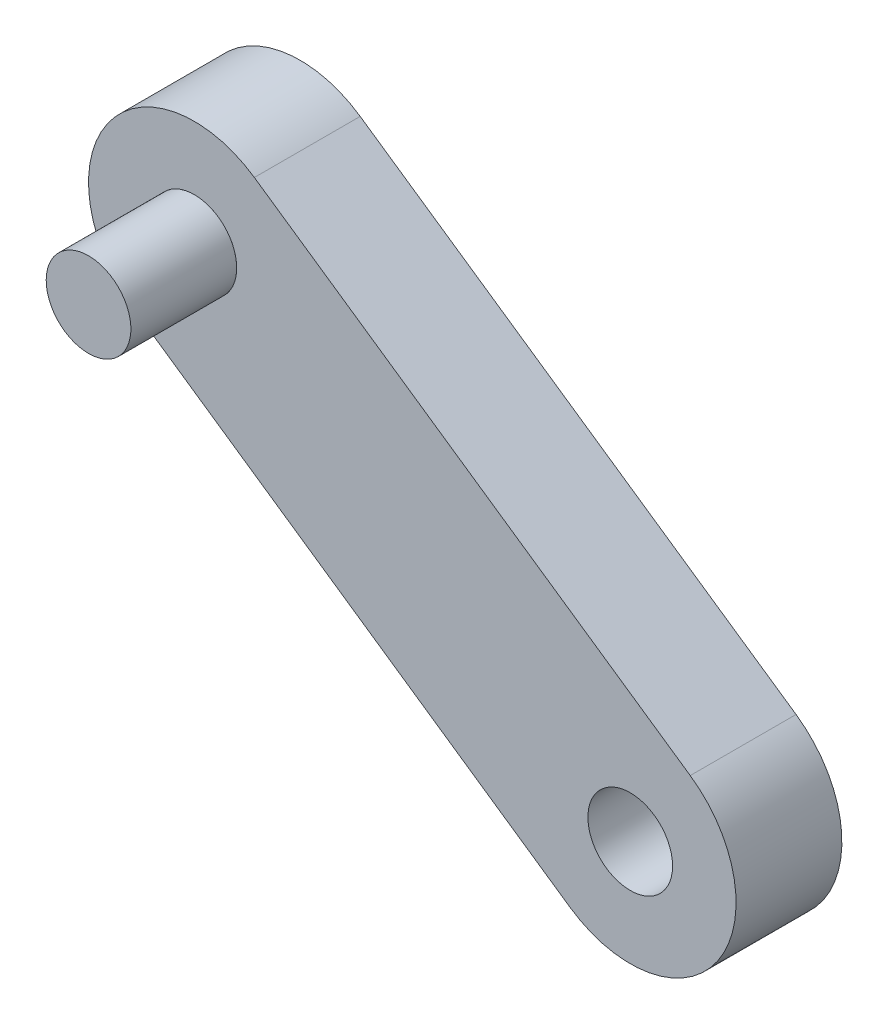
ISO-10303-21;
HEADER;
FILE_DESCRIPTION(('STEP AP214'),'2;1');
FILE_NAME('part.step','',(''),(''),'','','');
FILE_SCHEMA(('AUTOMOTIVE_DESIGN { 1 0 10303 214 1 1 1 1 }'));
ENDSEC;
DATA;
#1=APPLICATION_CONTEXT('core data for automotive mechanical design processes');
#2=APPLICATION_PROTOCOL_DEFINITION('international standard','automotive_design',2000,#1);
#3=PRODUCT_CONTEXT('',#1,'mechanical');
#4=PRODUCT('Part','Part','',(#3));
#5=PRODUCT_RELATED_PRODUCT_CATEGORY('part','',(#4));
#6=PRODUCT_DEFINITION_FORMATION('','',#4);
#7=PRODUCT_DEFINITION_CONTEXT('part definition',#1,'design');
#8=PRODUCT_DEFINITION('design','',#6,#7);
#9=PRODUCT_DEFINITION_SHAPE('','',#8);
#10=(LENGTH_UNIT() NAMED_UNIT(*) SI_UNIT(.MILLI.,.METRE.));
#11=(NAMED_UNIT(*) PLANE_ANGLE_UNIT() SI_UNIT($,.RADIAN.));
#12=(NAMED_UNIT(*) SI_UNIT($,.STERADIAN.) SOLID_ANGLE_UNIT());
#13=UNCERTAINTY_MEASURE_WITH_UNIT(LENGTH_MEASURE(1.E-05),#10,'distance_accuracy_value','');
#14=(GEOMETRIC_REPRESENTATION_CONTEXT(3) GLOBAL_UNCERTAINTY_ASSIGNED_CONTEXT((#13)) GLOBAL_UNIT_ASSIGNED_CONTEXT((#10,
#11,#12)) REPRESENTATION_CONTEXT('',''));
#15=CARTESIAN_POINT('',(0.,0.,0.));
#16=DIRECTION('',(0.,0.,1.));
#17=DIRECTION('',(1.,0.,0.));
#18=AXIS2_PLACEMENT_3D('',#15,#16,#17);
#19=CARTESIAN_POINT('',(-44.3801418640162,84.6953489238267,5.));
#20=DIRECTION('',(0.,0.,-1.));
#21=DIRECTION('',(1.,0.,0.));
#22=AXIS2_PLACEMENT_3D('',#19,#20,#21);
#23=CYLINDRICAL_SURFACE('',#22,2.);
#24=CARTESIAN_POINT('',(-44.3801418640162,84.6953489238267,5.));
#25=DIRECTION('',(0.,0.,-1.));
#26=DIRECTION('',(-1.,0.,0.));
#27=AXIS2_PLACEMENT_3D('',#24,#25,#26);
#28=CIRCLE('',#27,2.);
#29=CARTESIAN_POINT('',(-46.3801418640162,84.6953489238267,5.));
#30=VERTEX_POINT('',#29);
#31=EDGE_CURVE('E11',#30,#30,#28,.T.);
#32=ORIENTED_EDGE('',*,*,#31,.T.);
#33=EDGE_LOOP('',(#32));
#34=FACE_BOUND('',#33,.T.);
#35=CARTESIAN_POINT('',(-44.3801418640162,84.6953489238267,0.));
#36=DIRECTION('',(0.,0.,-1.));
#37=DIRECTION('',(-1.,0.,0.));
#38=AXIS2_PLACEMENT_3D('',#35,#36,#37);
#39=CIRCLE('',#38,2.);
#40=CARTESIAN_POINT('',(-46.3801418640162,84.6953489238267,0.));
#41=VERTEX_POINT('',#40);
#42=EDGE_CURVE('E50',#41,#41,#39,.T.);
#43=ORIENTED_EDGE('',*,*,#42,.F.);
#44=EDGE_LOOP('',(#43));
#45=FACE_BOUND('',#44,.T.);
#46=ADVANCED_FACE('F47',(#34,#45),#23,.T.);
#47=CARTESIAN_POINT('',(-44.3801418640162,84.6953489238267,5.));
#48=DIRECTION('',(0.,0.,1.));
#49=DIRECTION('',(-1.,0.,0.));
#50=AXIS2_PLACEMENT_3D('',#47,#48,#49);
#51=PLANE('',#50);
#52=ORIENTED_EDGE('',*,*,#31,.F.);
#53=EDGE_LOOP('',(#52));
#54=FACE_BOUND('',#53,.T.);
#55=ADVANCED_FACE('F62',(#54),#51,.T.);
#56=CARTESIAN_POINT('',(-44.3801418640162,84.6953489238267,0.));
#57=DIRECTION('',(0.,0.,1.));
#58=DIRECTION('',(-1.,0.,0.));
#59=AXIS2_PLACEMENT_3D('',#56,#57,#58);
#60=PLANE('',#59);
#61=ORIENTED_EDGE('',*,*,#42,.T.);
#62=EDGE_LOOP('',(#61));
#63=FACE_BOUND('',#62,.T.);
#64=ADVANCED_FACE('F59',(#63),#60,.F.);
#65=CLOSED_SHELL('',(#46,#55,#64));
#66=MANIFOLD_SOLID_BREP('B2',#65);
#67=CARTESIAN_POINT('',(22.4546862512256,32.6242146663216,-5.));
#68=DIRECTION('',(0.566966615087807,0.823740770737903,0.));
#69=DIRECTION('',(-0.823740770737903,0.566966615087807,0.));
#70=AXIS2_PLACEMENT_3D('',#67,#68,#69);
#71=PLANE('',#70);
#72=DIRECTION('',(0.823740770737903,-0.566966615087807,0.));
#73=VECTOR('',#72,1.);
#74=CARTESIAN_POINT('',(22.4546862512256,32.6242146663216,0.));
#75=LINE('',#74,#73);
#76=CARTESIAN_POINT('',(-47.2149749394553,80.5766450701372,0.));
#77=VERTEX_POINT('',#76);
#78=CARTESIAN_POINT('',(-26.6214556710077,66.402479692942,0.));
#79=VERTEX_POINT('',#78);
#80=EDGE_CURVE('E160',#77,#79,#75,.T.);
#81=ORIENTED_EDGE('',*,*,#80,.F.);
#82=DIRECTION('',(0.,0.,1.));
#83=VECTOR('',#82,1.);
#84=CARTESIAN_POINT('',(-47.2149749394553,80.5766450701372,-5.));
#85=LINE('',#84,#83);
#86=CARTESIAN_POINT('',(-47.2149749394553,80.5766450701372,-5.));
#87=VERTEX_POINT('',#86);
#88=EDGE_CURVE('E153',#87,#77,#85,.T.);
#89=ORIENTED_EDGE('',*,*,#88,.F.);
#90=DIRECTION('',(0.823740770737903,-0.566966615087807,0.));
#91=VECTOR('',#90,1.);
#92=CARTESIAN_POINT('',(22.4546862512256,32.6242146663216,-5.));
#93=LINE('',#92,#91);
#94=CARTESIAN_POINT('',(-26.6214556710077,66.402479692942,-5.));
#95=VERTEX_POINT('',#94);
#96=EDGE_CURVE('E146',#87,#95,#93,.T.);
#97=ORIENTED_EDGE('',*,*,#96,.T.);
#98=DIRECTION('',(0.,0.,1.));
#99=VECTOR('',#98,1.);
#100=CARTESIAN_POINT('',(-26.6214556710077,66.402479692942,-5.));
#101=LINE('',#100,#99);
#102=EDGE_CURVE('E45',#95,#79,#101,.T.);
#103=ORIENTED_EDGE('',*,*,#102,.T.);
#104=EDGE_LOOP('',(#81,#89,#97,#103));
#105=FACE_BOUND('',#104,.T.);
#106=ADVANCED_FACE('F88',(#105),#71,.F.);
#107=CARTESIAN_POINT('',(-23.7866225955687,70.5211835466315,-5.));
#108=DIRECTION('',(0.,0.,1.));
#109=DIRECTION('',(-1.,0.,0.));
#110=AXIS2_PLACEMENT_3D('',#107,#108,#109);
#111=CYLINDRICAL_SURFACE('',#110,4.99999999999997);
#112=CARTESIAN_POINT('',(-23.7866225955687,70.5211835466315,0.));
#113=DIRECTION('',(0.,0.,1.));
#114=DIRECTION('',(1.,0.,0.));
#115=AXIS2_PLACEMENT_3D('',#112,#113,#114);
#116=CIRCLE('',#115,4.99999999999997);
#117=CARTESIAN_POINT('',(-20.9517895201297,74.639887400321,0.));
#118=VERTEX_POINT('',#117);
#119=EDGE_CURVE('E162',#79,#118,#116,.T.);
#120=ORIENTED_EDGE('',*,*,#119,.F.);
#121=ORIENTED_EDGE('',*,*,#102,.F.);
#122=CARTESIAN_POINT('',(-23.7866225955687,70.5211835466315,-5.));
#123=DIRECTION('',(0.,0.,1.));
#124=DIRECTION('',(1.,0.,0.));
#125=AXIS2_PLACEMENT_3D('',#122,#123,#124);
#126=CIRCLE('',#125,4.99999999999997);
#127=CARTESIAN_POINT('',(-20.9517895201297,74.639887400321,-5.));
#128=VERTEX_POINT('',#127);
#129=EDGE_CURVE('E130',#95,#128,#126,.T.);
#130=ORIENTED_EDGE('',*,*,#129,.T.);
#131=DIRECTION('',(0.,0.,1.));
#132=VECTOR('',#131,1.);
#133=CARTESIAN_POINT('',(-20.9517895201297,74.639887400321,-5.));
#134=LINE('',#133,#132);
#135=EDGE_CURVE('E97',#128,#118,#134,.T.);
#136=ORIENTED_EDGE('',*,*,#135,.T.);
#137=EDGE_LOOP('',(#120,#121,#130,#136));
#138=FACE_BOUND('',#137,.T.);
#139=ADVANCED_FACE('F144',(#138),#111,.T.);
#140=CARTESIAN_POINT('',(28.1243524021036,40.8616223737004,-5.));
#141=DIRECTION('',(0.56696661508781,0.823740770737901,0.));
#142=DIRECTION('',(-0.823740770737901,0.56696661508781,0.));
#143=AXIS2_PLACEMENT_3D('',#140,#141,#142);
#144=PLANE('',#143);
#145=DIRECTION('',(0.823740770737901,-0.56696661508781,0.));
#146=VECTOR('',#145,1.);
#147=CARTESIAN_POINT('',(28.1243524021036,40.8616223737004,0.));
#148=LINE('',#147,#146);
#149=CARTESIAN_POINT('',(-41.5453087885772,88.8140527775162,0.));
#150=VERTEX_POINT('',#149);
#151=EDGE_CURVE('E140',#150,#118,#148,.T.);
#152=ORIENTED_EDGE('',*,*,#151,.T.);
#153=ORIENTED_EDGE('',*,*,#135,.F.);
#154=DIRECTION('',(0.823740770737901,-0.56696661508781,0.));
#155=VECTOR('',#154,1.);
#156=CARTESIAN_POINT('',(28.1243524021036,40.8616223737004,-5.));
#157=LINE('',#156,#155);
#158=CARTESIAN_POINT('',(-41.5453087885772,88.8140527775162,-5.));
#159=VERTEX_POINT('',#158);
#160=EDGE_CURVE('E133',#159,#128,#157,.T.);
#161=ORIENTED_EDGE('',*,*,#160,.F.);
#162=DIRECTION('',(0.,0.,1.));
#163=VECTOR('',#162,1.);
#164=CARTESIAN_POINT('',(-41.5453087885772,88.8140527775162,-5.));
#165=LINE('',#164,#163);
#166=EDGE_CURVE('E143',#159,#150,#165,.T.);
#167=ORIENTED_EDGE('',*,*,#166,.T.);
#168=EDGE_LOOP('',(#152,#153,#161,#167));
#169=FACE_BOUND('',#168,.T.);
#170=ADVANCED_FACE('F139',(#169),#144,.T.);
#171=CARTESIAN_POINT('',(-44.3801418640162,84.6953489238267,-5.));
#172=DIRECTION('',(0.,0.,1.));
#173=DIRECTION('',(-1.,0.,0.));
#174=AXIS2_PLACEMENT_3D('',#171,#172,#173);
#175=CYLINDRICAL_SURFACE('',#174,2.);
#176=CARTESIAN_POINT('',(-44.3801418640162,84.6953489238267,-5.));
#177=DIRECTION('',(0.,0.,1.));
#178=DIRECTION('',(1.,0.,0.));
#179=AXIS2_PLACEMENT_3D('',#176,#177,#178);
#180=CIRCLE('',#179,2.);
#181=CARTESIAN_POINT('',(-42.3801418640162,84.6953489238267,-5.));
#182=VERTEX_POINT('',#181);
#183=EDGE_CURVE('E148',#182,#182,#180,.T.);
#184=ORIENTED_EDGE('',*,*,#183,.F.);
#185=EDGE_LOOP('',(#184));
#186=FACE_BOUND('',#185,.T.);
#187=CARTESIAN_POINT('',(-44.3801418640162,84.6953489238267,0.));
#188=DIRECTION('',(0.,0.,1.));
#189=DIRECTION('',(1.,0.,0.));
#190=AXIS2_PLACEMENT_3D('',#187,#188,#189);
#191=CIRCLE('',#190,2.);
#192=CARTESIAN_POINT('',(-42.3801418640162,84.6953489238267,0.));
#193=VERTEX_POINT('',#192);
#194=EDGE_CURVE('E157',#193,#193,#191,.T.);
#195=ORIENTED_EDGE('',*,*,#194,.T.);
#196=EDGE_LOOP('',(#195));
#197=FACE_BOUND('',#196,.T.);
#198=ADVANCED_FACE('F181',(#186,#197),#175,.F.);
#199=CARTESIAN_POINT('',(-23.7866225955687,70.5211835466315,-5.));
#200=DIRECTION('',(0.,0.,1.));
#201=DIRECTION('',(-1.,0.,0.));
#202=AXIS2_PLACEMENT_3D('',#199,#200,#201);
#203=CYLINDRICAL_SURFACE('',#202,2.00000000000001);
#204=CARTESIAN_POINT('',(-23.7866225955687,70.5211835466315,-5.));
#205=DIRECTION('',(0.,0.,1.));
#206=DIRECTION('',(1.,0.,0.));
#207=AXIS2_PLACEMENT_3D('',#204,#205,#206);
#208=CIRCLE('',#207,2.00000000000001);
#209=CARTESIAN_POINT('',(-21.7866225955687,70.5211835466315,-5.));
#210=VERTEX_POINT('',#209);
#211=EDGE_CURVE('E166',#210,#210,#208,.T.);
#212=ORIENTED_EDGE('',*,*,#211,.F.);
#213=EDGE_LOOP('',(#212));
#214=FACE_BOUND('',#213,.T.);
#215=CARTESIAN_POINT('',(-23.7866225955687,70.5211835466315,0.));
#216=DIRECTION('',(0.,0.,1.));
#217=DIRECTION('',(1.,0.,0.));
#218=AXIS2_PLACEMENT_3D('',#215,#216,#217);
#219=CIRCLE('',#218,2.00000000000001);
#220=CARTESIAN_POINT('',(-21.7866225955687,70.5211835466315,0.));
#221=VERTEX_POINT('',#220);
#222=EDGE_CURVE('E154',#221,#221,#219,.T.);
#223=ORIENTED_EDGE('',*,*,#222,.T.);
#224=EDGE_LOOP('',(#223));
#225=FACE_BOUND('',#224,.T.);
#226=ADVANCED_FACE('F90',(#214,#225),#203,.F.);
#227=CARTESIAN_POINT('',(-44.3801418640162,84.6953489238267,-5.));
#228=DIRECTION('',(0.,0.,1.));
#229=DIRECTION('',(-1.,0.,0.));
#230=AXIS2_PLACEMENT_3D('',#227,#228,#229);
#231=CYLINDRICAL_SURFACE('',#230,5.);
#232=CARTESIAN_POINT('',(-44.3801418640162,84.6953489238267,0.));
#233=DIRECTION('',(0.,0.,1.));
#234=DIRECTION('',(1.,0.,0.));
#235=AXIS2_PLACEMENT_3D('',#232,#233,#234);
#236=CIRCLE('',#235,5.);
#237=EDGE_CURVE('E119',#150,#77,#236,.T.);
#238=ORIENTED_EDGE('',*,*,#237,.F.);
#239=ORIENTED_EDGE('',*,*,#166,.F.);
#240=CARTESIAN_POINT('',(-44.3801418640162,84.6953489238267,-5.));
#241=DIRECTION('',(0.,0.,1.));
#242=DIRECTION('',(1.,0.,0.));
#243=AXIS2_PLACEMENT_3D('',#240,#241,#242);
#244=CIRCLE('',#243,5.);
#245=EDGE_CURVE('E105',#159,#87,#244,.T.);
#246=ORIENTED_EDGE('',*,*,#245,.T.);
#247=ORIENTED_EDGE('',*,*,#88,.T.);
#248=EDGE_LOOP('',(#238,#239,#246,#247));
#249=FACE_BOUND('',#248,.T.);
#250=ADVANCED_FACE('F172',(#249),#231,.T.);
#251=CARTESIAN_POINT('',(0.,0.,-5.));
#252=DIRECTION('',(0.,0.,-1.));
#253=DIRECTION('',(1.,0.,0.));
#254=AXIS2_PLACEMENT_3D('',#251,#252,#253);
#255=PLANE('',#254);
#256=ORIENTED_EDGE('',*,*,#211,.T.);
#257=EDGE_LOOP('',(#256));
#258=FACE_BOUND('',#257,.T.);
#259=ORIENTED_EDGE('',*,*,#183,.T.);
#260=EDGE_LOOP('',(#259));
#261=FACE_BOUND('',#260,.T.);
#262=ORIENTED_EDGE('',*,*,#96,.F.);
#263=ORIENTED_EDGE('',*,*,#245,.F.);
#264=ORIENTED_EDGE('',*,*,#160,.T.);
#265=ORIENTED_EDGE('',*,*,#129,.F.);
#266=EDGE_LOOP('',(#262,#263,#264,#265));
#267=FACE_BOUND('',#266,.T.);
#268=ADVANCED_FACE('F135',(#258,#261,#267),#255,.T.);
#269=CARTESIAN_POINT('',(0.,0.,0.));
#270=DIRECTION('',(0.,0.,-1.));
#271=DIRECTION('',(1.,0.,0.));
#272=AXIS2_PLACEMENT_3D('',#269,#270,#271);
#273=PLANE('',#272);
#274=ORIENTED_EDGE('',*,*,#222,.F.);
#275=EDGE_LOOP('',(#274));
#276=FACE_BOUND('',#275,.T.);
#277=ORIENTED_EDGE('',*,*,#194,.F.);
#278=EDGE_LOOP('',(#277));
#279=FACE_BOUND('',#278,.T.);
#280=ORIENTED_EDGE('',*,*,#80,.T.);
#281=ORIENTED_EDGE('',*,*,#119,.T.);
#282=ORIENTED_EDGE('',*,*,#151,.F.);
#283=ORIENTED_EDGE('',*,*,#237,.T.);
#284=EDGE_LOOP('',(#280,#281,#282,#283));
#285=FACE_BOUND('',#284,.T.);
#286=ADVANCED_FACE('F168',(#276,#279,#285),#273,.F.);
#287=CLOSED_SHELL('',(#106,#139,#170,#198,#226,#250,#268,#286));
#288=MANIFOLD_SOLID_BREP('B6',#287);
#289=ADVANCED_BREP_SHAPE_REPRESENTATION('',(#18,#66,#288),#14);
#290=SHAPE_DEFINITION_REPRESENTATION(#9,#289);
ENDSEC;
END-ISO-10303-21;
